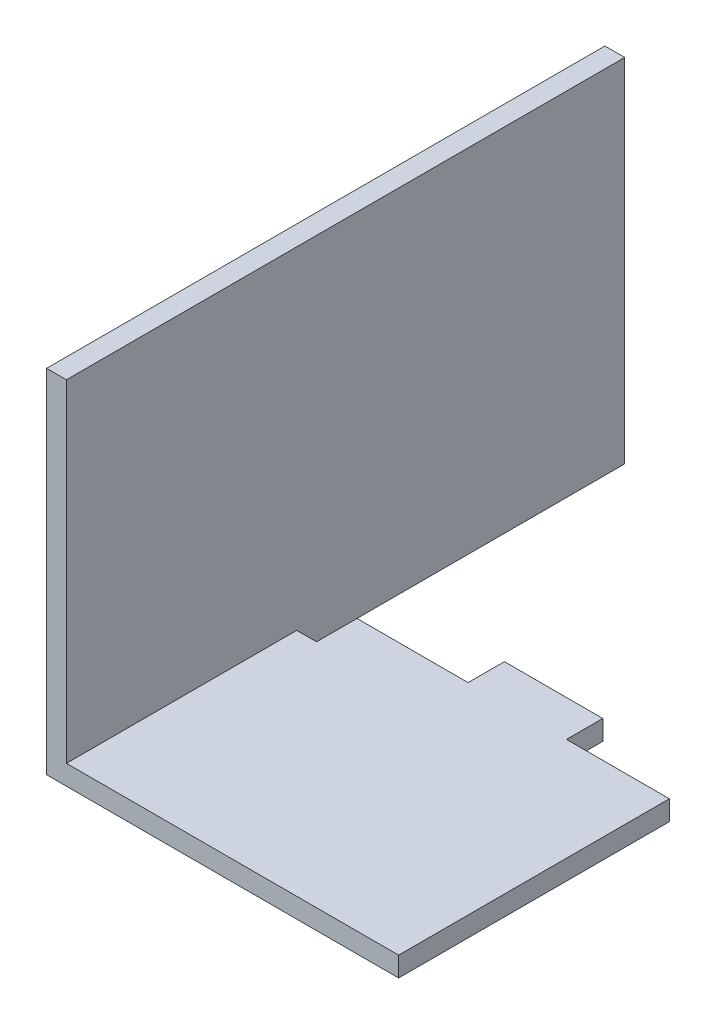
ISO-10303-21;
HEADER;
FILE_DESCRIPTION(('STEP AP214'),'2;1');
FILE_NAME('part.step','',(''),(''),'','','');
FILE_SCHEMA(('AUTOMOTIVE_DESIGN { 1 0 10303 214 1 1 1 1 }'));
ENDSEC;
DATA;
#1=APPLICATION_CONTEXT('core data for automotive mechanical design processes');
#2=APPLICATION_PROTOCOL_DEFINITION('international standard','automotive_design',2000,#1);
#3=PRODUCT_CONTEXT('',#1,'mechanical');
#4=PRODUCT('Part','Part','',(#3));
#5=PRODUCT_RELATED_PRODUCT_CATEGORY('part','',(#4));
#6=PRODUCT_DEFINITION_FORMATION('','',#4);
#7=PRODUCT_DEFINITION_CONTEXT('part definition',#1,'design');
#8=PRODUCT_DEFINITION('design','',#6,#7);
#9=PRODUCT_DEFINITION_SHAPE('','',#8);
#10=(LENGTH_UNIT() NAMED_UNIT(*) SI_UNIT(.MILLI.,.METRE.));
#11=(NAMED_UNIT(*) PLANE_ANGLE_UNIT() SI_UNIT($,.RADIAN.));
#12=(NAMED_UNIT(*) SI_UNIT($,.STERADIAN.) SOLID_ANGLE_UNIT());
#13=UNCERTAINTY_MEASURE_WITH_UNIT(LENGTH_MEASURE(1.E-05),#10,'distance_accuracy_value','');
#14=(GEOMETRIC_REPRESENTATION_CONTEXT(3) GLOBAL_UNCERTAINTY_ASSIGNED_CONTEXT((#13)) GLOBAL_UNIT_ASSIGNED_CONTEXT((#10,
#11,#12)) REPRESENTATION_CONTEXT('',''));
#15=CARTESIAN_POINT('',(0.,0.,0.));
#16=DIRECTION('',(0.,0.,1.));
#17=DIRECTION('',(1.,0.,0.));
#18=AXIS2_PLACEMENT_3D('',#15,#16,#17);
#19=CARTESIAN_POINT('',(1.42,0.,40.));
#20=DIRECTION('',(0.,-1.,0.));
#21=DIRECTION('',(0.,0.,-1.));
#22=AXIS2_PLACEMENT_3D('',#19,#20,#21);
#23=PLANE('',#22);
#24=DIRECTION('',(-1.,0.,0.));
#25=VECTOR('',#24,1.);
#26=CARTESIAN_POINT('',(1.42,0.,0.));
#27=LINE('',#26,#25);
#28=CARTESIAN_POINT('',(1.42,0.,0.));
#29=VERTEX_POINT('',#28);
#30=CARTESIAN_POINT('',(0.,0.,0.));
#31=VERTEX_POINT('',#30);
#32=EDGE_CURVE('E175',#29,#31,#27,.T.);
#33=ORIENTED_EDGE('',*,*,#32,.T.);
#34=DIRECTION('',(0.,0.,-1.));
#35=VECTOR('',#34,1.);
#36=CARTESIAN_POINT('',(0.,0.,40.));
#37=LINE('',#36,#35);
#38=CARTESIAN_POINT('',(0.,0.,40.));
#39=VERTEX_POINT('',#38);
#40=EDGE_CURVE('E11',#39,#31,#37,.T.);
#41=ORIENTED_EDGE('',*,*,#40,.F.);
#42=DIRECTION('',(-1.,0.,0.));
#43=VECTOR('',#42,1.);
#44=CARTESIAN_POINT('',(1.42,0.,40.));
#45=LINE('',#44,#43);
#46=CARTESIAN_POINT('',(1.42,0.,40.));
#47=VERTEX_POINT('',#46);
#48=EDGE_CURVE('E173',#47,#39,#45,.T.);
#49=ORIENTED_EDGE('',*,*,#48,.F.);
#50=DIRECTION('',(0.,0.,-1.));
#51=VECTOR('',#50,1.);
#52=CARTESIAN_POINT('',(1.42,0.,40.));
#53=LINE('',#52,#51);
#54=EDGE_CURVE('E150',#47,#29,#53,.T.);
#55=ORIENTED_EDGE('',*,*,#54,.T.);
#56=EDGE_LOOP('',(#33,#41,#49,#55));
#57=FACE_BOUND('',#56,.T.);
#58=ADVANCED_FACE('F29',(#57),#23,.F.);
#59=CARTESIAN_POINT('',(0.,0.,40.));
#60=DIRECTION('',(1.,0.,0.));
#61=DIRECTION('',(0.,0.,-1.));
#62=AXIS2_PLACEMENT_3D('',#59,#60,#61);
#63=PLANE('',#62);
#64=DIRECTION('',(0.,-1.,0.));
#65=VECTOR('',#64,1.);
#66=CARTESIAN_POINT('',(0.,0.,0.));
#67=LINE('',#66,#65);
#68=CARTESIAN_POINT('',(0.,-25.22,0.));
#69=VERTEX_POINT('',#68);
#70=EDGE_CURVE('E171',#31,#69,#67,.T.);
#71=ORIENTED_EDGE('',*,*,#70,.T.);
#72=DIRECTION('',(0.,0.,-1.));
#73=VECTOR('',#72,1.);
#74=CARTESIAN_POINT('',(0.,-25.22,40.));
#75=LINE('',#74,#73);
#76=CARTESIAN_POINT('',(0.,-25.22,40.));
#77=VERTEX_POINT('',#76);
#78=EDGE_CURVE('E36',#77,#69,#75,.T.);
#79=ORIENTED_EDGE('',*,*,#78,.F.);
#80=DIRECTION('',(0.,-1.,0.));
#81=VECTOR('',#80,1.);
#82=CARTESIAN_POINT('',(0.,0.,40.));
#83=LINE('',#82,#81);
#84=EDGE_CURVE('E180',#39,#77,#83,.T.);
#85=ORIENTED_EDGE('',*,*,#84,.F.);
#86=ORIENTED_EDGE('',*,*,#40,.T.);
#87=EDGE_LOOP('',(#71,#79,#85,#86));
#88=FACE_BOUND('',#87,.T.);
#89=ADVANCED_FACE('F271',(#88),#63,.F.);
#90=CARTESIAN_POINT('',(25.22,-25.22,40.));
#91=DIRECTION('',(0.,1.,0.));
#92=DIRECTION('',(-1.,0.,0.));
#93=AXIS2_PLACEMENT_3D('',#90,#91,#92);
#94=PLANE('',#93);
#95=DIRECTION('',(0.,0.,1.));
#96=VECTOR('',#95,1.);
#97=CARTESIAN_POINT('',(17.85,-25.22,20.6));
#98=LINE('',#97,#96);
#99=CARTESIAN_POINT('',(17.85,-25.22,18.));
#100=VERTEX_POINT('',#99);
#101=CARTESIAN_POINT('',(17.85,-25.22,20.6));
#102=VERTEX_POINT('',#101);
#103=EDGE_CURVE('E234',#100,#102,#98,.T.);
#104=ORIENTED_EDGE('',*,*,#103,.T.);
#105=DIRECTION('',(1.,0.,0.));
#106=VECTOR('',#105,1.);
#107=CARTESIAN_POINT('',(25.22,-25.22,20.6));
#108=LINE('',#107,#106);
#109=CARTESIAN_POINT('',(25.22,-25.22,20.6));
#110=VERTEX_POINT('',#109);
#111=EDGE_CURVE('E136',#102,#110,#108,.T.);
#112=ORIENTED_EDGE('',*,*,#111,.T.);
#113=DIRECTION('',(0.,0.,-1.));
#114=VECTOR('',#113,1.);
#115=CARTESIAN_POINT('',(25.22,-25.22,40.));
#116=LINE('',#115,#114);
#117=CARTESIAN_POINT('',(25.22,-25.22,40.));
#118=VERTEX_POINT('',#117);
#119=EDGE_CURVE('E152',#118,#110,#116,.T.);
#120=ORIENTED_EDGE('',*,*,#119,.F.);
#121=DIRECTION('',(1.,0.,0.));
#122=VECTOR('',#121,1.);
#123=CARTESIAN_POINT('',(25.22,-25.22,40.));
#124=LINE('',#123,#122);
#125=EDGE_CURVE('E168',#77,#118,#124,.T.);
#126=ORIENTED_EDGE('',*,*,#125,.F.);
#127=ORIENTED_EDGE('',*,*,#78,.T.);
#128=DIRECTION('',(1.,0.,0.));
#129=VECTOR('',#128,1.);
#130=CARTESIAN_POINT('',(25.22,-25.22,0.));
#131=LINE('',#130,#129);
#132=CARTESIAN_POINT('',(1.41999999999999,-25.22,0.));
#133=VERTEX_POINT('',#132);
#134=EDGE_CURVE('E166',#69,#133,#131,.T.);
#135=ORIENTED_EDGE('',*,*,#134,.T.);
#136=DIRECTION('',(0.,0.,1.));
#137=VECTOR('',#136,1.);
#138=CARTESIAN_POINT('',(1.41999999999999,-25.22,23.5));
#139=LINE('',#138,#137);
#140=CARTESIAN_POINT('',(1.41999999999999,-25.22,23.5));
#141=VERTEX_POINT('',#140);
#142=EDGE_CURVE('E223',#133,#141,#139,.T.);
#143=ORIENTED_EDGE('',*,*,#142,.T.);
#144=DIRECTION('',(1.,0.,0.));
#145=VECTOR('',#144,1.);
#146=CARTESIAN_POINT('',(2.84,-25.22,23.5));
#147=LINE('',#146,#145);
#148=CARTESIAN_POINT('',(2.84,-25.22,23.5));
#149=VERTEX_POINT('',#148);
#150=EDGE_CURVE('E131',#141,#149,#147,.T.);
#151=ORIENTED_EDGE('',*,*,#150,.T.);
#152=DIRECTION('',(0.,0.,-1.));
#153=VECTOR('',#152,1.);
#154=CARTESIAN_POINT('',(2.83999999999987,-25.22,20.6));
#155=LINE('',#154,#153);
#156=CARTESIAN_POINT('',(2.83999999999987,-25.22,20.6));
#157=VERTEX_POINT('',#156);
#158=EDGE_CURVE('E218',#149,#157,#155,.T.);
#159=ORIENTED_EDGE('',*,*,#158,.T.);
#160=DIRECTION('',(1.,0.,0.));
#161=VECTOR('',#160,1.);
#162=CARTESIAN_POINT('',(10.8,-25.22,20.6));
#163=LINE('',#162,#161);
#164=CARTESIAN_POINT('',(10.8,-25.22,20.6));
#165=VERTEX_POINT('',#164);
#166=EDGE_CURVE('E221',#157,#165,#163,.T.);
#167=ORIENTED_EDGE('',*,*,#166,.T.);
#168=DIRECTION('',(0.,0.,-1.));
#169=VECTOR('',#168,1.);
#170=CARTESIAN_POINT('',(10.8,-25.22,18.));
#171=LINE('',#170,#169);
#172=CARTESIAN_POINT('',(10.8,-25.22,18.));
#173=VERTEX_POINT('',#172);
#174=EDGE_CURVE('E229',#165,#173,#171,.T.);
#175=ORIENTED_EDGE('',*,*,#174,.T.);
#176=DIRECTION('',(1.,0.,0.));
#177=VECTOR('',#176,1.);
#178=CARTESIAN_POINT('',(17.85,-25.22,18.));
#179=LINE('',#178,#177);
#180=EDGE_CURVE('E232',#173,#100,#179,.T.);
#181=ORIENTED_EDGE('',*,*,#180,.T.);
#182=EDGE_LOOP('',(#104,#112,#120,#126,#127,#135,#143,#151,#159,#167,#175,#181));
#183=FACE_BOUND('',#182,.T.);
#184=ADVANCED_FACE('F165',(#183),#94,.F.);
#185=CARTESIAN_POINT('',(25.22,-25.22,40.));
#186=DIRECTION('',(-1.,0.,0.));
#187=DIRECTION('',(0.,0.,1.));
#188=AXIS2_PLACEMENT_3D('',#185,#186,#187);
#189=PLANE('',#188);
#190=ORIENTED_EDGE('',*,*,#119,.T.);
#191=DIRECTION('',(0.,1.,0.));
#192=VECTOR('',#191,1.);
#193=CARTESIAN_POINT('',(25.22,-25.22,20.6));
#194=LINE('',#193,#192);
#195=CARTESIAN_POINT('',(25.22,-23.8,20.6));
#196=VERTEX_POINT('',#195);
#197=EDGE_CURVE('E195',#110,#196,#194,.T.);
#198=ORIENTED_EDGE('',*,*,#197,.T.);
#199=DIRECTION('',(0.,0.,-1.));
#200=VECTOR('',#199,1.);
#201=CARTESIAN_POINT('',(25.22,-23.8,40.));
#202=LINE('',#201,#200);
#203=CARTESIAN_POINT('',(25.22,-23.8,40.));
#204=VERTEX_POINT('',#203);
#205=EDGE_CURVE('E149',#204,#196,#202,.T.);
#206=ORIENTED_EDGE('',*,*,#205,.F.);
#207=DIRECTION('',(0.,1.,0.));
#208=VECTOR('',#207,1.);
#209=CARTESIAN_POINT('',(25.22,-25.22,40.));
#210=LINE('',#209,#208);
#211=EDGE_CURVE('E183',#118,#204,#210,.T.);
#212=ORIENTED_EDGE('',*,*,#211,.F.);
#213=EDGE_LOOP('',(#190,#198,#206,#212));
#214=FACE_BOUND('',#213,.T.);
#215=ADVANCED_FACE('F194',(#214),#189,.F.);
#216=CARTESIAN_POINT('',(25.22,-23.8,40.));
#217=DIRECTION('',(0.,-1.,0.));
#218=DIRECTION('',(1.,0.,0.));
#219=AXIS2_PLACEMENT_3D('',#216,#217,#218);
#220=PLANE('',#219);
#221=ORIENTED_EDGE('',*,*,#205,.T.);
#222=DIRECTION('',(1.,0.,0.));
#223=VECTOR('',#222,1.);
#224=CARTESIAN_POINT('',(25.22,-23.8,20.6));
#225=LINE('',#224,#223);
#226=CARTESIAN_POINT('',(17.85,-23.8,20.6));
#227=VERTEX_POINT('',#226);
#228=EDGE_CURVE('E191',#227,#196,#225,.T.);
#229=ORIENTED_EDGE('',*,*,#228,.F.);
#230=DIRECTION('',(0.,0.,1.));
#231=VECTOR('',#230,1.);
#232=CARTESIAN_POINT('',(17.85,-23.8,20.6));
#233=LINE('',#232,#231);
#234=CARTESIAN_POINT('',(17.85,-23.8,18.));
#235=VERTEX_POINT('',#234);
#236=EDGE_CURVE('E239',#235,#227,#233,.T.);
#237=ORIENTED_EDGE('',*,*,#236,.F.);
#238=DIRECTION('',(1.,0.,0.));
#239=VECTOR('',#238,1.);
#240=CARTESIAN_POINT('',(17.85,-23.8,18.));
#241=LINE('',#240,#239);
#242=CARTESIAN_POINT('',(10.8,-23.8,18.));
#243=VERTEX_POINT('',#242);
#244=EDGE_CURVE('E243',#243,#235,#241,.T.);
#245=ORIENTED_EDGE('',*,*,#244,.F.);
#246=DIRECTION('',(0.,0.,-1.));
#247=VECTOR('',#246,1.);
#248=CARTESIAN_POINT('',(10.8,-23.8,18.));
#249=LINE('',#248,#247);
#250=CARTESIAN_POINT('',(10.8,-23.8,20.6));
#251=VERTEX_POINT('',#250);
#252=EDGE_CURVE('E245',#251,#243,#249,.T.);
#253=ORIENTED_EDGE('',*,*,#252,.F.);
#254=DIRECTION('',(1.,0.,0.));
#255=VECTOR('',#254,1.);
#256=CARTESIAN_POINT('',(10.8,-23.8,20.6));
#257=LINE('',#256,#255);
#258=CARTESIAN_POINT('',(2.83999999999987,-23.8,20.6));
#259=VERTEX_POINT('',#258);
#260=EDGE_CURVE('E250',#259,#251,#257,.T.);
#261=ORIENTED_EDGE('',*,*,#260,.F.);
#262=DIRECTION('',(0.,0.,-1.));
#263=VECTOR('',#262,1.);
#264=CARTESIAN_POINT('',(2.83999999999987,-23.8,20.6));
#265=LINE('',#264,#263);
#266=CARTESIAN_POINT('',(2.84,-23.8,23.5));
#267=VERTEX_POINT('',#266);
#268=EDGE_CURVE('E146',#267,#259,#265,.T.);
#269=ORIENTED_EDGE('',*,*,#268,.F.);
#270=DIRECTION('',(1.,0.,0.));
#271=VECTOR('',#270,1.);
#272=CARTESIAN_POINT('',(2.84,-23.8,23.5));
#273=LINE('',#272,#271);
#274=CARTESIAN_POINT('',(1.41999999999999,-23.8,23.5));
#275=VERTEX_POINT('',#274);
#276=EDGE_CURVE('E128',#275,#267,#273,.T.);
#277=ORIENTED_EDGE('',*,*,#276,.F.);
#278=DIRECTION('',(0.,0.,-1.));
#279=VECTOR('',#278,1.);
#280=CARTESIAN_POINT('',(1.42,-23.8,40.));
#281=LINE('',#280,#279);
#282=CARTESIAN_POINT('',(1.42,-23.8,40.));
#283=VERTEX_POINT('',#282);
#284=EDGE_CURVE('E143',#283,#275,#281,.T.);
#285=ORIENTED_EDGE('',*,*,#284,.F.);
#286=DIRECTION('',(-1.,0.,0.));
#287=VECTOR('',#286,1.);
#288=CARTESIAN_POINT('',(25.22,-23.8,40.));
#289=LINE('',#288,#287);
#290=EDGE_CURVE('E185',#204,#283,#289,.T.);
#291=ORIENTED_EDGE('',*,*,#290,.F.);
#292=EDGE_LOOP('',(#221,#229,#237,#245,#253,#261,#269,#277,#285,#291));
#293=FACE_BOUND('',#292,.T.);
#294=ADVANCED_FACE('F141',(#293),#220,.F.);
#295=CARTESIAN_POINT('',(1.42,0.,40.));
#296=DIRECTION('',(-1.,0.,0.));
#297=DIRECTION('',(0.,-1.,0.));
#298=AXIS2_PLACEMENT_3D('',#295,#296,#297);
#299=PLANE('',#298);
#300=DIRECTION('',(0.,1.,0.));
#301=VECTOR('',#300,1.);
#302=CARTESIAN_POINT('',(1.42,0.,0.));
#303=LINE('',#302,#301);
#304=EDGE_CURVE('E43',#133,#29,#303,.T.);
#305=ORIENTED_EDGE('',*,*,#304,.T.);
#306=ORIENTED_EDGE('',*,*,#54,.F.);
#307=DIRECTION('',(0.,1.,0.));
#308=VECTOR('',#307,1.);
#309=CARTESIAN_POINT('',(1.42,0.,40.));
#310=LINE('',#309,#308);
#311=EDGE_CURVE('E51',#283,#47,#310,.T.);
#312=ORIENTED_EDGE('',*,*,#311,.F.);
#313=ORIENTED_EDGE('',*,*,#284,.T.);
#314=DIRECTION('',(0.,1.,0.));
#315=VECTOR('',#314,1.);
#316=CARTESIAN_POINT('',(1.41999999999999,-25.22,23.5));
#317=LINE('',#316,#315);
#318=EDGE_CURVE('E125',#141,#275,#317,.T.);
#319=ORIENTED_EDGE('',*,*,#318,.F.);
#320=ORIENTED_EDGE('',*,*,#142,.F.);
#321=EDGE_LOOP('',(#305,#306,#312,#313,#319,#320));
#322=FACE_BOUND('',#321,.T.);
#323=ADVANCED_FACE('F148',(#322),#299,.F.);
#324=CARTESIAN_POINT('',(0.,0.,40.));
#325=DIRECTION('',(0.,0.,1.));
#326=DIRECTION('',(1.,0.,0.));
#327=AXIS2_PLACEMENT_3D('',#324,#325,#326);
#328=PLANE('',#327);
#329=ORIENTED_EDGE('',*,*,#48,.T.);
#330=ORIENTED_EDGE('',*,*,#84,.T.);
#331=ORIENTED_EDGE('',*,*,#125,.T.);
#332=ORIENTED_EDGE('',*,*,#211,.T.);
#333=ORIENTED_EDGE('',*,*,#290,.T.);
#334=ORIENTED_EDGE('',*,*,#311,.T.);
#335=EDGE_LOOP('',(#329,#330,#331,#332,#333,#334));
#336=FACE_BOUND('',#335,.T.);
#337=ADVANCED_FACE('F186',(#336),#328,.T.);
#338=CARTESIAN_POINT('',(0.,0.,0.));
#339=DIRECTION('',(0.,0.,1.));
#340=DIRECTION('',(1.,0.,0.));
#341=AXIS2_PLACEMENT_3D('',#338,#339,#340);
#342=PLANE('',#341);
#343=ORIENTED_EDGE('',*,*,#304,.F.);
#344=ORIENTED_EDGE('',*,*,#134,.F.);
#345=ORIENTED_EDGE('',*,*,#70,.F.);
#346=ORIENTED_EDGE('',*,*,#32,.F.);
#347=EDGE_LOOP('',(#343,#344,#345,#346));
#348=FACE_BOUND('',#347,.T.);
#349=ADVANCED_FACE('F170',(#348),#342,.F.);
#350=CARTESIAN_POINT('',(25.22,-25.22,20.6));
#351=DIRECTION('',(0.,0.,1.));
#352=DIRECTION('',(1.,0.,0.));
#353=AXIS2_PLACEMENT_3D('',#350,#351,#352);
#354=PLANE('',#353);
#355=ORIENTED_EDGE('',*,*,#228,.T.);
#356=ORIENTED_EDGE('',*,*,#197,.F.);
#357=ORIENTED_EDGE('',*,*,#111,.F.);
#358=DIRECTION('',(0.,1.,0.));
#359=VECTOR('',#358,1.);
#360=CARTESIAN_POINT('',(17.85,-25.22,20.6));
#361=LINE('',#360,#359);
#362=EDGE_CURVE('E199',#102,#227,#361,.T.);
#363=ORIENTED_EDGE('',*,*,#362,.T.);
#364=EDGE_LOOP('',(#355,#356,#357,#363));
#365=FACE_BOUND('',#364,.T.);
#366=ADVANCED_FACE('F236',(#365),#354,.F.);
#367=CARTESIAN_POINT('',(17.85,-25.22,20.6));
#368=DIRECTION('',(-1.,0.,0.));
#369=DIRECTION('',(0.,-1.,0.));
#370=AXIS2_PLACEMENT_3D('',#367,#368,#369);
#371=PLANE('',#370);
#372=ORIENTED_EDGE('',*,*,#236,.T.);
#373=ORIENTED_EDGE('',*,*,#362,.F.);
#374=ORIENTED_EDGE('',*,*,#103,.F.);
#375=DIRECTION('',(0.,1.,0.));
#376=VECTOR('',#375,1.);
#377=CARTESIAN_POINT('',(17.85,-25.22,18.));
#378=LINE('',#377,#376);
#379=EDGE_CURVE('E202',#100,#235,#378,.T.);
#380=ORIENTED_EDGE('',*,*,#379,.T.);
#381=EDGE_LOOP('',(#372,#373,#374,#380));
#382=FACE_BOUND('',#381,.T.);
#383=ADVANCED_FACE('F240',(#382),#371,.F.);
#384=CARTESIAN_POINT('',(17.85,-25.22,18.));
#385=DIRECTION('',(0.,0.,1.));
#386=DIRECTION('',(1.,0.,0.));
#387=AXIS2_PLACEMENT_3D('',#384,#385,#386);
#388=PLANE('',#387);
#389=ORIENTED_EDGE('',*,*,#244,.T.);
#390=ORIENTED_EDGE('',*,*,#379,.F.);
#391=ORIENTED_EDGE('',*,*,#180,.F.);
#392=DIRECTION('',(0.,1.,0.));
#393=VECTOR('',#392,1.);
#394=CARTESIAN_POINT('',(10.8,-25.22,18.));
#395=LINE('',#394,#393);
#396=EDGE_CURVE('E208',#173,#243,#395,.T.);
#397=ORIENTED_EDGE('',*,*,#396,.T.);
#398=EDGE_LOOP('',(#389,#390,#391,#397));
#399=FACE_BOUND('',#398,.T.);
#400=ADVANCED_FACE('F261',(#399),#388,.F.);
#401=CARTESIAN_POINT('',(10.8,-25.22,18.));
#402=DIRECTION('',(1.,0.,0.));
#403=DIRECTION('',(0.,1.,0.));
#404=AXIS2_PLACEMENT_3D('',#401,#402,#403);
#405=PLANE('',#404);
#406=ORIENTED_EDGE('',*,*,#252,.T.);
#407=ORIENTED_EDGE('',*,*,#396,.F.);
#408=ORIENTED_EDGE('',*,*,#174,.F.);
#409=DIRECTION('',(0.,1.,0.));
#410=VECTOR('',#409,1.);
#411=CARTESIAN_POINT('',(10.8,-25.22,20.6));
#412=LINE('',#411,#410);
#413=EDGE_CURVE('E210',#165,#251,#412,.T.);
#414=ORIENTED_EDGE('',*,*,#413,.T.);
#415=EDGE_LOOP('',(#406,#407,#408,#414));
#416=FACE_BOUND('',#415,.T.);
#417=ADVANCED_FACE('F258',(#416),#405,.F.);
#418=CARTESIAN_POINT('',(10.8,-25.22,20.6));
#419=DIRECTION('',(0.,0.,1.));
#420=DIRECTION('',(1.,0.,0.));
#421=AXIS2_PLACEMENT_3D('',#418,#419,#420);
#422=PLANE('',#421);
#423=ORIENTED_EDGE('',*,*,#260,.T.);
#424=ORIENTED_EDGE('',*,*,#413,.F.);
#425=ORIENTED_EDGE('',*,*,#166,.F.);
#426=DIRECTION('',(0.,1.,0.));
#427=VECTOR('',#426,1.);
#428=CARTESIAN_POINT('',(2.83999999999987,-25.22,20.6));
#429=LINE('',#428,#427);
#430=EDGE_CURVE('E212',#157,#259,#429,.T.);
#431=ORIENTED_EDGE('',*,*,#430,.T.);
#432=EDGE_LOOP('',(#423,#424,#425,#431));
#433=FACE_BOUND('',#432,.T.);
#434=ADVANCED_FACE('F255',(#433),#422,.F.);
#435=CARTESIAN_POINT('',(2.83999999999987,-25.22,20.6));
#436=DIRECTION('',(1.,0.,0.));
#437=DIRECTION('',(0.,0.,-1.));
#438=AXIS2_PLACEMENT_3D('',#435,#436,#437);
#439=PLANE('',#438);
#440=ORIENTED_EDGE('',*,*,#268,.T.);
#441=ORIENTED_EDGE('',*,*,#430,.F.);
#442=ORIENTED_EDGE('',*,*,#158,.F.);
#443=DIRECTION('',(0.,1.,0.));
#444=VECTOR('',#443,1.);
#445=CARTESIAN_POINT('',(2.84,-25.22,23.5));
#446=LINE('',#445,#444);
#447=EDGE_CURVE('E135',#149,#267,#446,.T.);
#448=ORIENTED_EDGE('',*,*,#447,.T.);
#449=EDGE_LOOP('',(#440,#441,#442,#448));
#450=FACE_BOUND('',#449,.T.);
#451=ADVANCED_FACE('F216',(#450),#439,.F.);
#452=CARTESIAN_POINT('',(2.84,-25.22,23.5));
#453=DIRECTION('',(0.,0.,1.));
#454=DIRECTION('',(1.,0.,0.));
#455=AXIS2_PLACEMENT_3D('',#452,#453,#454);
#456=PLANE('',#455);
#457=ORIENTED_EDGE('',*,*,#276,.T.);
#458=ORIENTED_EDGE('',*,*,#447,.F.);
#459=ORIENTED_EDGE('',*,*,#150,.F.);
#460=ORIENTED_EDGE('',*,*,#318,.T.);
#461=EDGE_LOOP('',(#457,#458,#459,#460));
#462=FACE_BOUND('',#461,.T.);
#463=ADVANCED_FACE('F127',(#462),#456,.F.);
#464=CLOSED_SHELL('',(#58,#89,#184,#215,#294,#323,#337,#349,#366,#383,#400,#417,#434,#451,#463));
#465=MANIFOLD_SOLID_BREP('B2',#464);
#466=ADVANCED_BREP_SHAPE_REPRESENTATION('',(#18,#465),#14);
#467=SHAPE_DEFINITION_REPRESENTATION(#9,#466);
ENDSEC;
END-ISO-10303-21;
